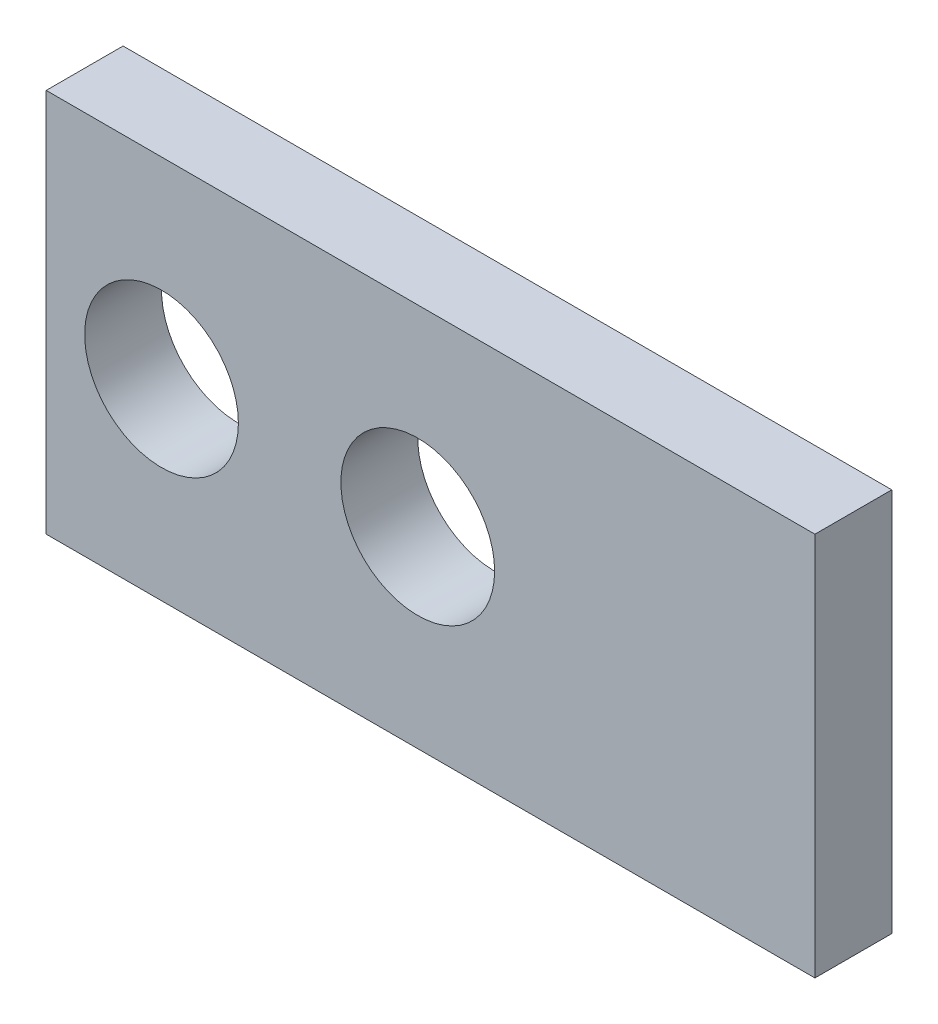
ISO-10303-21;
HEADER;
FILE_DESCRIPTION(('STEP AP214'),'2;1');
FILE_NAME('part.step','',(''),(''),'','','');
FILE_SCHEMA(('AUTOMOTIVE_DESIGN { 1 0 10303 214 1 1 1 1 }'));
ENDSEC;
DATA;
#1=APPLICATION_CONTEXT('core data for automotive mechanical design processes');
#2=APPLICATION_PROTOCOL_DEFINITION('international standard','automotive_design',2000,#1);
#3=PRODUCT_CONTEXT('',#1,'mechanical');
#4=PRODUCT('Part','Part','',(#3));
#5=PRODUCT_RELATED_PRODUCT_CATEGORY('part','',(#4));
#6=PRODUCT_DEFINITION_FORMATION('','',#4);
#7=PRODUCT_DEFINITION_CONTEXT('part definition',#1,'design');
#8=PRODUCT_DEFINITION('design','',#6,#7);
#9=PRODUCT_DEFINITION_SHAPE('','',#8);
#10=(LENGTH_UNIT() NAMED_UNIT(*) SI_UNIT(.MILLI.,.METRE.));
#11=(NAMED_UNIT(*) PLANE_ANGLE_UNIT() SI_UNIT($,.RADIAN.));
#12=(NAMED_UNIT(*) SI_UNIT($,.STERADIAN.) SOLID_ANGLE_UNIT());
#13=UNCERTAINTY_MEASURE_WITH_UNIT(LENGTH_MEASURE(1.E-05),#10,'distance_accuracy_value','');
#14=(GEOMETRIC_REPRESENTATION_CONTEXT(3) GLOBAL_UNCERTAINTY_ASSIGNED_CONTEXT((#13)) GLOBAL_UNIT_ASSIGNED_CONTEXT((#10,
#11,#12)) REPRESENTATION_CONTEXT('',''));
#15=CARTESIAN_POINT('',(0.,0.,0.));
#16=DIRECTION('',(0.,0.,1.));
#17=DIRECTION('',(1.,0.,0.));
#18=AXIS2_PLACEMENT_3D('',#15,#16,#17);
#19=CARTESIAN_POINT('',(50.,-25.,10.));
#20=DIRECTION('',(-1.,0.,0.));
#21=DIRECTION('',(0.,0.,1.));
#22=AXIS2_PLACEMENT_3D('',#19,#20,#21);
#23=PLANE('',#22);
#24=DIRECTION('',(0.,1.,0.));
#25=VECTOR('',#24,1.);
#26=CARTESIAN_POINT('',(50.,-25.,0.));
#27=LINE('',#26,#25);
#28=CARTESIAN_POINT('',(50.,-25.,0.));
#29=VERTEX_POINT('',#28);
#30=CARTESIAN_POINT('',(50.,25.,0.));
#31=VERTEX_POINT('',#30);
#32=EDGE_CURVE('E95',#29,#31,#27,.T.);
#33=ORIENTED_EDGE('',*,*,#32,.T.);
#34=DIRECTION('',(0.,0.,-1.));
#35=VECTOR('',#34,1.);
#36=CARTESIAN_POINT('',(50.,25.,10.));
#37=LINE('',#36,#35);
#38=CARTESIAN_POINT('',(50.,25.,10.));
#39=VERTEX_POINT('',#38);
#40=EDGE_CURVE('E11',#39,#31,#37,.T.);
#41=ORIENTED_EDGE('',*,*,#40,.F.);
#42=DIRECTION('',(0.,1.,0.));
#43=VECTOR('',#42,1.);
#44=CARTESIAN_POINT('',(50.,-25.,10.));
#45=LINE('',#44,#43);
#46=CARTESIAN_POINT('',(50.,-25.,10.));
#47=VERTEX_POINT('',#46);
#48=EDGE_CURVE('E83',#47,#39,#45,.T.);
#49=ORIENTED_EDGE('',*,*,#48,.F.);
#50=DIRECTION('',(0.,0.,-1.));
#51=VECTOR('',#50,1.);
#52=CARTESIAN_POINT('',(50.,-25.,10.));
#53=LINE('',#52,#51);
#54=EDGE_CURVE('E91',#47,#29,#53,.T.);
#55=ORIENTED_EDGE('',*,*,#54,.T.);
#56=EDGE_LOOP('',(#33,#41,#49,#55));
#57=FACE_BOUND('',#56,.T.);
#58=ADVANCED_FACE('F32',(#57),#23,.F.);
#59=CARTESIAN_POINT('',(-50.,25.,10.));
#60=DIRECTION('',(0.,-1.,0.));
#61=DIRECTION('',(0.,0.,-1.));
#62=AXIS2_PLACEMENT_3D('',#59,#60,#61);
#63=PLANE('',#62);
#64=DIRECTION('',(-1.,0.,0.));
#65=VECTOR('',#64,1.);
#66=CARTESIAN_POINT('',(-50.,25.,0.));
#67=LINE('',#66,#65);
#68=CARTESIAN_POINT('',(-50.,25.,0.));
#69=VERTEX_POINT('',#68);
#70=EDGE_CURVE('E87',#31,#69,#67,.T.);
#71=ORIENTED_EDGE('',*,*,#70,.T.);
#72=DIRECTION('',(0.,0.,-1.));
#73=VECTOR('',#72,1.);
#74=CARTESIAN_POINT('',(-50.,25.,10.));
#75=LINE('',#74,#73);
#76=CARTESIAN_POINT('',(-50.,25.,10.));
#77=VERTEX_POINT('',#76);
#78=EDGE_CURVE('E40',#77,#69,#75,.T.);
#79=ORIENTED_EDGE('',*,*,#78,.F.);
#80=DIRECTION('',(-1.,0.,0.));
#81=VECTOR('',#80,1.);
#82=CARTESIAN_POINT('',(-50.,25.,10.));
#83=LINE('',#82,#81);
#84=EDGE_CURVE('E78',#39,#77,#83,.T.);
#85=ORIENTED_EDGE('',*,*,#84,.F.);
#86=ORIENTED_EDGE('',*,*,#40,.T.);
#87=EDGE_LOOP('',(#71,#79,#85,#86));
#88=FACE_BOUND('',#87,.T.);
#89=ADVANCED_FACE('F86',(#88),#63,.F.);
#90=CARTESIAN_POINT('',(-50.,-25.,10.));
#91=DIRECTION('',(1.,0.,0.));
#92=DIRECTION('',(0.,0.,-1.));
#93=AXIS2_PLACEMENT_3D('',#90,#91,#92);
#94=PLANE('',#93);
#95=DIRECTION('',(0.,-1.,0.));
#96=VECTOR('',#95,1.);
#97=CARTESIAN_POINT('',(-50.,-25.,0.));
#98=LINE('',#97,#96);
#99=CARTESIAN_POINT('',(-50.,-25.,0.));
#100=VERTEX_POINT('',#99);
#101=EDGE_CURVE('E65',#69,#100,#98,.T.);
#102=ORIENTED_EDGE('',*,*,#101,.T.);
#103=DIRECTION('',(0.,0.,-1.));
#104=VECTOR('',#103,1.);
#105=CARTESIAN_POINT('',(-50.,-25.,10.));
#106=LINE('',#105,#104);
#107=CARTESIAN_POINT('',(-50.,-25.,10.));
#108=VERTEX_POINT('',#107);
#109=EDGE_CURVE('E88',#108,#100,#106,.T.);
#110=ORIENTED_EDGE('',*,*,#109,.F.);
#111=DIRECTION('',(0.,-1.,0.));
#112=VECTOR('',#111,1.);
#113=CARTESIAN_POINT('',(-50.,-25.,10.));
#114=LINE('',#113,#112);
#115=EDGE_CURVE('E81',#77,#108,#114,.T.);
#116=ORIENTED_EDGE('',*,*,#115,.F.);
#117=ORIENTED_EDGE('',*,*,#78,.T.);
#118=EDGE_LOOP('',(#102,#110,#116,#117));
#119=FACE_BOUND('',#118,.T.);
#120=ADVANCED_FACE('F89',(#119),#94,.F.);
#121=CARTESIAN_POINT('',(-50.,-25.,10.));
#122=DIRECTION('',(0.,1.,0.));
#123=DIRECTION('',(0.,0.,1.));
#124=AXIS2_PLACEMENT_3D('',#121,#122,#123);
#125=PLANE('',#124);
#126=DIRECTION('',(1.,0.,0.));
#127=VECTOR('',#126,1.);
#128=CARTESIAN_POINT('',(-50.,-25.,0.));
#129=LINE('',#128,#127);
#130=EDGE_CURVE('E71',#100,#29,#129,.T.);
#131=ORIENTED_EDGE('',*,*,#130,.T.);
#132=ORIENTED_EDGE('',*,*,#54,.F.);
#133=DIRECTION('',(1.,0.,0.));
#134=VECTOR('',#133,1.);
#135=CARTESIAN_POINT('',(-50.,-25.,10.));
#136=LINE('',#135,#134);
#137=EDGE_CURVE('E48',#108,#47,#136,.T.);
#138=ORIENTED_EDGE('',*,*,#137,.F.);
#139=ORIENTED_EDGE('',*,*,#109,.T.);
#140=EDGE_LOOP('',(#131,#132,#138,#139));
#141=FACE_BOUND('',#140,.T.);
#142=ADVANCED_FACE('F103',(#141),#125,.F.);
#143=CARTESIAN_POINT('',(0.,0.,10.));
#144=DIRECTION('',(0.,0.,-1.));
#145=DIRECTION('',(-1.,0.,0.));
#146=AXIS2_PLACEMENT_3D('',#143,#144,#145);
#147=PLANE('',#146);
#148=CARTESIAN_POINT('',(-1.66666666666667,0.,10.));
#149=DIRECTION('',(0.,0.,1.));
#150=DIRECTION('',(1.,0.,0.));
#151=AXIS2_PLACEMENT_3D('',#148,#149,#150);
#152=CIRCLE('',#151,9.99999999999999);
#153=CARTESIAN_POINT('',(8.33333333333332,0.,10.));
#154=VERTEX_POINT('',#153);
#155=EDGE_CURVE('E114',#154,#154,#152,.T.);
#156=ORIENTED_EDGE('',*,*,#155,.F.);
#157=EDGE_LOOP('',(#156));
#158=FACE_BOUND('',#157,.T.);
#159=CARTESIAN_POINT('',(-35.,0.,10.));
#160=DIRECTION('',(0.,0.,1.));
#161=DIRECTION('',(1.,0.,0.));
#162=AXIS2_PLACEMENT_3D('',#159,#160,#161);
#163=CIRCLE('',#162,9.99999999999999);
#164=CARTESIAN_POINT('',(-25.,0.,10.));
#165=VERTEX_POINT('',#164);
#166=EDGE_CURVE('E111',#165,#165,#163,.T.);
#167=ORIENTED_EDGE('',*,*,#166,.F.);
#168=EDGE_LOOP('',(#167));
#169=FACE_BOUND('',#168,.T.);
#170=ORIENTED_EDGE('',*,*,#48,.T.);
#171=ORIENTED_EDGE('',*,*,#84,.T.);
#172=ORIENTED_EDGE('',*,*,#115,.T.);
#173=ORIENTED_EDGE('',*,*,#137,.T.);
#174=EDGE_LOOP('',(#170,#171,#172,#173));
#175=FACE_BOUND('',#174,.T.);
#176=ADVANCED_FACE('F79',(#158,#169,#175),#147,.F.);
#177=CARTESIAN_POINT('',(0.,0.,0.));
#178=DIRECTION('',(0.,0.,-1.));
#179=DIRECTION('',(-1.,0.,0.));
#180=AXIS2_PLACEMENT_3D('',#177,#178,#179);
#181=PLANE('',#180);
#182=CARTESIAN_POINT('',(-1.66666666666667,0.,0.));
#183=DIRECTION('',(0.,0.,1.));
#184=DIRECTION('',(1.,0.,0.));
#185=AXIS2_PLACEMENT_3D('',#182,#183,#184);
#186=CIRCLE('',#185,9.99999999999999);
#187=CARTESIAN_POINT('',(8.33333333333332,0.,0.));
#188=VERTEX_POINT('',#187);
#189=EDGE_CURVE('E117',#188,#188,#186,.T.);
#190=ORIENTED_EDGE('',*,*,#189,.T.);
#191=EDGE_LOOP('',(#190));
#192=FACE_BOUND('',#191,.T.);
#193=CARTESIAN_POINT('',(-35.,0.,0.));
#194=DIRECTION('',(0.,0.,1.));
#195=DIRECTION('',(1.,0.,0.));
#196=AXIS2_PLACEMENT_3D('',#193,#194,#195);
#197=CIRCLE('',#196,9.99999999999999);
#198=CARTESIAN_POINT('',(-25.,0.,0.));
#199=VERTEX_POINT('',#198);
#200=EDGE_CURVE('E98',#199,#199,#197,.T.);
#201=ORIENTED_EDGE('',*,*,#200,.T.);
#202=EDGE_LOOP('',(#201));
#203=FACE_BOUND('',#202,.T.);
#204=ORIENTED_EDGE('',*,*,#32,.F.);
#205=ORIENTED_EDGE('',*,*,#130,.F.);
#206=ORIENTED_EDGE('',*,*,#101,.F.);
#207=ORIENTED_EDGE('',*,*,#70,.F.);
#208=EDGE_LOOP('',(#204,#205,#206,#207));
#209=FACE_BOUND('',#208,.T.);
#210=ADVANCED_FACE('F106',(#192,#203,#209),#181,.T.);
#211=CARTESIAN_POINT('',(-35.,0.,10.));
#212=DIRECTION('',(0.,0.,1.));
#213=DIRECTION('',(1.,0.,0.));
#214=AXIS2_PLACEMENT_3D('',#211,#212,#213);
#215=CYLINDRICAL_SURFACE('',#214,9.99999999999999);
#216=ORIENTED_EDGE('',*,*,#200,.F.);
#217=EDGE_LOOP('',(#216));
#218=FACE_BOUND('',#217,.T.);
#219=ORIENTED_EDGE('',*,*,#166,.T.);
#220=EDGE_LOOP('',(#219));
#221=FACE_BOUND('',#220,.T.);
#222=ADVANCED_FACE('F126',(#218,#221),#215,.F.);
#223=CARTESIAN_POINT('',(-1.66666666666667,0.,10.));
#224=DIRECTION('',(0.,0.,1.));
#225=DIRECTION('',(1.,0.,0.));
#226=AXIS2_PLACEMENT_3D('',#223,#224,#225);
#227=CYLINDRICAL_SURFACE('',#226,9.99999999999999);
#228=ORIENTED_EDGE('',*,*,#189,.F.);
#229=EDGE_LOOP('',(#228));
#230=FACE_BOUND('',#229,.T.);
#231=ORIENTED_EDGE('',*,*,#155,.T.);
#232=EDGE_LOOP('',(#231));
#233=FACE_BOUND('',#232,.T.);
#234=ADVANCED_FACE('F123',(#230,#233),#227,.F.);
#235=CLOSED_SHELL('',(#58,#89,#120,#142,#176,#210,#222,#234));
#236=MANIFOLD_SOLID_BREP('B2',#235);
#237=ADVANCED_BREP_SHAPE_REPRESENTATION('',(#18,#236),#14);
#238=SHAPE_DEFINITION_REPRESENTATION(#9,#237);
ENDSEC;
END-ISO-10303-21;
